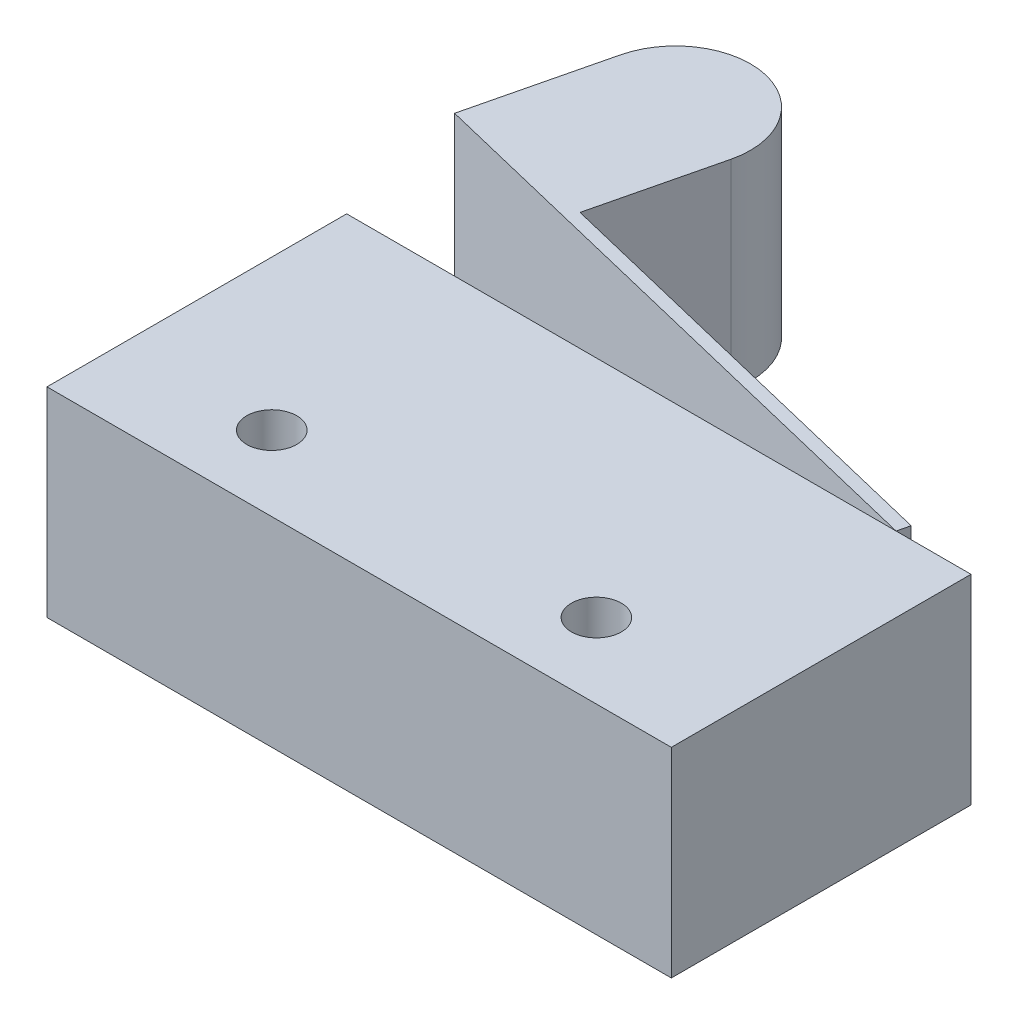
ISO-10303-21;
HEADER;
FILE_DESCRIPTION(('STEP AP214'),'2;1');
FILE_NAME('part.step','',(''),(''),'','','');
FILE_SCHEMA(('AUTOMOTIVE_DESIGN { 1 0 10303 214 1 1 1 1 }'));
ENDSEC;
DATA;
#1=APPLICATION_CONTEXT('core data for automotive mechanical design processes');
#2=APPLICATION_PROTOCOL_DEFINITION('international standard','automotive_design',2000,#1);
#3=PRODUCT_CONTEXT('',#1,'mechanical');
#4=PRODUCT('Part','Part','',(#3));
#5=PRODUCT_RELATED_PRODUCT_CATEGORY('part','',(#4));
#6=PRODUCT_DEFINITION_FORMATION('','',#4);
#7=PRODUCT_DEFINITION_CONTEXT('part definition',#1,'design');
#8=PRODUCT_DEFINITION('design','',#6,#7);
#9=PRODUCT_DEFINITION_SHAPE('','',#8);
#10=(LENGTH_UNIT() NAMED_UNIT(*) SI_UNIT(.MILLI.,.METRE.));
#11=(NAMED_UNIT(*) PLANE_ANGLE_UNIT() SI_UNIT($,.RADIAN.));
#12=(NAMED_UNIT(*) SI_UNIT($,.STERADIAN.) SOLID_ANGLE_UNIT());
#13=UNCERTAINTY_MEASURE_WITH_UNIT(LENGTH_MEASURE(1.E-05),#10,'distance_accuracy_value','');
#14=(GEOMETRIC_REPRESENTATION_CONTEXT(3) GLOBAL_UNCERTAINTY_ASSIGNED_CONTEXT((#13)) GLOBAL_UNIT_ASSIGNED_CONTEXT((#10,
#11,#12)) REPRESENTATION_CONTEXT('',''));
#15=CARTESIAN_POINT('',(0.,0.,0.));
#16=DIRECTION('',(0.,0.,1.));
#17=DIRECTION('',(1.,0.,0.));
#18=AXIS2_PLACEMENT_3D('',#15,#16,#17);
#19=CARTESIAN_POINT('',(7.540625,6.35,-4.7625));
#20=DIRECTION('',(-0.971918724719173,0.,-0.235316791879066));
#21=DIRECTION('',(-0.235316791879066,0.,0.971918724719174));
#22=AXIS2_PLACEMENT_3D('',#19,#20,#21);
#23=PLANE('',#22);
#24=DIRECTION('',(0.235316791879066,0.,-0.971918724719173));
#25=VECTOR('',#24,1.);
#26=CARTESIAN_POINT('',(7.540625,0.,-4.7625));
#27=LINE('',#26,#25);
#28=CARTESIAN_POINT('',(7.540625,0.,-4.7625));
#29=VERTEX_POINT('',#28);
#30=CARTESIAN_POINT('',(7.634016351777,0.,-5.14823024387292));
#31=VERTEX_POINT('',#30);
#32=EDGE_CURVE('E123',#29,#31,#27,.T.);
#33=ORIENTED_EDGE('',*,*,#32,.T.);
#34=DIRECTION('',(0.,-1.,0.));
#35=VECTOR('',#34,1.);
#36=CARTESIAN_POINT('',(7.634016351777,6.35,-5.14823024387292));
#37=LINE('',#36,#35);
#38=CARTESIAN_POINT('',(7.634016351777,6.35,-5.14823024387292));
#39=VERTEX_POINT('',#38);
#40=EDGE_CURVE('E105',#39,#31,#37,.T.);
#41=ORIENTED_EDGE('',*,*,#40,.F.);
#42=DIRECTION('',(0.235316791879066,0.,-0.971918724719173));
#43=VECTOR('',#42,1.);
#44=CARTESIAN_POINT('',(7.540625,6.35,-4.7625));
#45=LINE('',#44,#43);
#46=CARTESIAN_POINT('',(7.540625,6.35,-4.7625));
#47=VERTEX_POINT('',#46);
#48=EDGE_CURVE('E111',#47,#39,#45,.T.);
#49=ORIENTED_EDGE('',*,*,#48,.F.);
#50=DIRECTION('',(0.,-1.,0.));
#51=VECTOR('',#50,1.);
#52=CARTESIAN_POINT('',(7.540625,6.35,-4.7625));
#53=LINE('',#52,#51);
#54=EDGE_CURVE('E150',#47,#29,#53,.T.);
#55=ORIENTED_EDGE('',*,*,#54,.T.);
#56=EDGE_LOOP('',(#33,#41,#49,#55));
#57=FACE_BOUND('',#56,.T.);
#58=ADVANCED_FACE('F45',(#57),#23,.F.);
#59=CARTESIAN_POINT('',(7.634016351777,6.35,-5.14823024387292));
#60=DIRECTION('',(-0.235316791879065,0.,0.971918724719174));
#61=DIRECTION('',(0.971918724719174,0.,0.235316791879065));
#62=AXIS2_PLACEMENT_3D('',#59,#60,#61);
#63=PLANE('',#62);
#64=DIRECTION('',(-0.971918724719174,0.,-0.235316791879065));
#65=VECTOR('',#64,1.);
#66=CARTESIAN_POINT('',(7.634016351777,0.,-5.14823024387292));
#67=LINE('',#66,#65);
#68=CARTESIAN_POINT('',(-6.25227242764819,0.,-8.51031890784506));
#69=VERTEX_POINT('',#68);
#70=EDGE_CURVE('E152',#31,#69,#67,.T.);
#71=ORIENTED_EDGE('',*,*,#70,.T.);
#72=DIRECTION('',(0.,-1.,0.));
#73=VECTOR('',#72,1.);
#74=CARTESIAN_POINT('',(-6.25227242764819,6.35,-8.51031890784506));
#75=LINE('',#74,#73);
#76=CARTESIAN_POINT('',(-6.25227242764819,6.35,-8.51031890784506));
#77=VERTEX_POINT('',#76);
#78=EDGE_CURVE('E108',#77,#69,#75,.T.);
#79=ORIENTED_EDGE('',*,*,#78,.F.);
#80=DIRECTION('',(-0.971918724719174,0.,-0.235316791879065));
#81=VECTOR('',#80,1.);
#82=CARTESIAN_POINT('',(7.634016351777,6.35,-5.14823024387292));
#83=LINE('',#82,#81);
#84=EDGE_CURVE('E101',#39,#77,#83,.T.);
#85=ORIENTED_EDGE('',*,*,#84,.F.);
#86=ORIENTED_EDGE('',*,*,#40,.T.);
#87=EDGE_LOOP('',(#71,#79,#85,#86));
#88=FACE_BOUND('',#87,.T.);
#89=ADVANCED_FACE('F103',(#88),#63,.F.);
#90=CARTESIAN_POINT('',(-4.75801079921613,6.35,-14.6820028098118));
#91=DIRECTION('',(-0.971918724719174,0.,-0.235316791879065));
#92=DIRECTION('',(-0.235316791879065,0.,0.971918724719174));
#93=AXIS2_PLACEMENT_3D('',#90,#91,#92);
#94=PLANE('',#93);
#95=DIRECTION('',(0.235316791879065,0.,-0.971918724719174));
#96=VECTOR('',#95,1.);
#97=CARTESIAN_POINT('',(-4.75801079921613,0.,-14.6820028098118));
#98=LINE('',#97,#96);
#99=CARTESIAN_POINT('',(-5.31835890987816,0.,-12.3676213465743));
#100=VERTEX_POINT('',#99);
#101=EDGE_CURVE('E142',#69,#100,#98,.T.);
#102=ORIENTED_EDGE('',*,*,#101,.T.);
#103=DIRECTION('',(0.,-1.,0.));
#104=VECTOR('',#103,1.);
#105=CARTESIAN_POINT('',(-5.31835890987816,6.35,-12.3676213465743));
#106=LINE('',#105,#104);
#107=CARTESIAN_POINT('',(-5.31835890987816,6.35,-12.3676213465743));
#108=VERTEX_POINT('',#107);
#109=EDGE_CURVE('E133',#100,#108,#106,.F.);
#110=ORIENTED_EDGE('',*,*,#109,.T.);
#111=DIRECTION('',(0.235316791879065,0.,-0.971918724719174));
#112=VECTOR('',#111,1.);
#113=CARTESIAN_POINT('',(-4.75801079921613,6.35,-14.6820028098118));
#114=LINE('',#113,#112);
#115=EDGE_CURVE('E110',#77,#108,#114,.T.);
#116=ORIENTED_EDGE('',*,*,#115,.F.);
#117=ORIENTED_EDGE('',*,*,#78,.T.);
#118=EDGE_LOOP('',(#102,#110,#116,#117));
#119=FACE_BOUND('',#118,.T.);
#120=ADVANCED_FACE('F140',(#119),#94,.F.);
#121=CARTESIAN_POINT('',(-10.9744267059003,6.35,-9.24528488529618));
#122=DIRECTION('',(0.971918724719176,0.,0.235316791879055));
#123=DIRECTION('',(0.235316791879055,0.,-0.971918724719176));
#124=AXIS2_PLACEMENT_3D('',#121,#122,#123);
#125=PLANE('',#124);
#126=DIRECTION('',(-0.235316791879065,0.,0.971918724719174));
#127=VECTOR('',#126,1.);
#128=CARTESIAN_POINT('',(-10.8810353541233,6.35,-9.6310151291691));
#129=LINE('',#128,#127);
#130=CARTESIAN_POINT('',(-9.94712183635323,6.35,-13.4883175678983));
#131=VERTEX_POINT('',#130);
#132=CARTESIAN_POINT('',(-10.9744267059003,6.35,-9.24528488529618));
#133=VERTEX_POINT('',#132);
#134=EDGE_CURVE('E145',#131,#133,#129,.T.);
#135=ORIENTED_EDGE('',*,*,#134,.F.);
#136=DIRECTION('',(0.,-1.,0.));
#137=VECTOR('',#136,1.);
#138=CARTESIAN_POINT('',(-9.94712183635327,6.35,-13.4883175678983));
#139=LINE('',#138,#137);
#140=CARTESIAN_POINT('',(-9.94712183635327,0.,-13.4883175678983));
#141=VERTEX_POINT('',#140);
#142=EDGE_CURVE('E13',#131,#141,#139,.T.);
#143=ORIENTED_EDGE('',*,*,#142,.T.);
#144=DIRECTION('',(-0.235316791879055,0.,0.971918724719176));
#145=VECTOR('',#144,1.);
#146=CARTESIAN_POINT('',(-10.9744267059003,0.,-9.24528488529618));
#147=LINE('',#146,#145);
#148=CARTESIAN_POINT('',(-10.9744267059003,0.,-9.24528488529618));
#149=VERTEX_POINT('',#148);
#150=EDGE_CURVE('E155',#141,#149,#147,.T.);
#151=ORIENTED_EDGE('',*,*,#150,.T.);
#152=DIRECTION('',(0.,-1.,0.));
#153=VECTOR('',#152,1.);
#154=CARTESIAN_POINT('',(-10.9744267059003,6.35,-9.24528488529618));
#155=LINE('',#154,#153);
#156=EDGE_CURVE('E128',#133,#149,#155,.T.);
#157=ORIENTED_EDGE('',*,*,#156,.F.);
#158=EDGE_LOOP('',(#135,#143,#151,#157));
#159=FACE_BOUND('',#158,.T.);
#160=ADVANCED_FACE('F173',(#159),#125,.F.);
#161=CARTESIAN_POINT('',(7.540625,6.35,-4.7625));
#162=DIRECTION('',(0.235316791879065,0.,-0.971918724719174));
#163=DIRECTION('',(-0.971918724719174,0.,-0.235316791879065));
#164=AXIS2_PLACEMENT_3D('',#161,#162,#163);
#165=PLANE('',#164);
#166=DIRECTION('',(0.971918724719174,0.,0.235316791879065));
#167=VECTOR('',#166,1.);
#168=CARTESIAN_POINT('',(7.540625,0.,-4.7625));
#169=LINE('',#168,#167);
#170=EDGE_CURVE('E120',#149,#29,#169,.T.);
#171=ORIENTED_EDGE('',*,*,#170,.T.);
#172=ORIENTED_EDGE('',*,*,#54,.F.);
#173=DIRECTION('',(0.971918724719174,0.,0.235316791879065));
#174=VECTOR('',#173,1.);
#175=CARTESIAN_POINT('',(7.540625,6.35,-4.7625));
#176=LINE('',#175,#174);
#177=EDGE_CURVE('E116',#133,#47,#176,.T.);
#178=ORIENTED_EDGE('',*,*,#177,.F.);
#179=ORIENTED_EDGE('',*,*,#156,.T.);
#180=EDGE_LOOP('',(#171,#172,#178,#179));
#181=FACE_BOUND('',#180,.T.);
#182=ADVANCED_FACE('F162',(#181),#165,.F.);
#183=CARTESIAN_POINT('',(0.,6.35,0.));
#184=DIRECTION('',(0.,1.,0.));
#185=DIRECTION('',(0.,0.,1.));
#186=AXIS2_PLACEMENT_3D('',#183,#184,#185);
#187=PLANE('',#186);
#188=ORIENTED_EDGE('',*,*,#115,.T.);
#189=CARTESIAN_POINT('',(-7.63274037311569,6.35,-12.9279694572363));
#190=DIRECTION('',(0.,1.,0.));
#191=DIRECTION('',(0.,0.,1.));
#192=AXIS2_PLACEMENT_3D('',#189,#190,#191);
#193=CIRCLE('',#192,2.38125);
#194=CARTESIAN_POINT('',(-7.07239226245371,6.35,-15.2423509204738));
#195=VERTEX_POINT('',#194);
#196=EDGE_CURVE('E54',#108,#195,#193,.T.);
#197=ORIENTED_EDGE('',*,*,#196,.T.);
#198=CARTESIAN_POINT('',(-7.63274037311573,6.35,-12.9279694572363));
#199=DIRECTION('',(0.,1.,0.));
#200=DIRECTION('',(0.,0.,1.));
#201=AXIS2_PLACEMENT_3D('',#198,#199,#200);
#202=CIRCLE('',#201,2.38125);
#203=EDGE_CURVE('E61',#195,#131,#202,.T.);
#204=ORIENTED_EDGE('',*,*,#203,.T.);
#205=ORIENTED_EDGE('',*,*,#134,.T.);
#206=ORIENTED_EDGE('',*,*,#177,.T.);
#207=ORIENTED_EDGE('',*,*,#48,.T.);
#208=ORIENTED_EDGE('',*,*,#84,.T.);
#209=EDGE_LOOP('',(#188,#197,#204,#205,#206,#207,#208));
#210=FACE_BOUND('',#209,.T.);
#211=ADVANCED_FACE('F114',(#210),#187,.T.);
#212=CARTESIAN_POINT('',(0.,0.,0.));
#213=DIRECTION('',(0.,1.,0.));
#214=DIRECTION('',(0.,0.,1.));
#215=AXIS2_PLACEMENT_3D('',#212,#213,#214);
#216=PLANE('',#215);
#217=CARTESIAN_POINT('',(-7.63274037311573,0.,-12.9279694572363));
#218=DIRECTION('',(0.,1.,0.));
#219=DIRECTION('',(0.,0.,1.));
#220=AXIS2_PLACEMENT_3D('',#217,#218,#219);
#221=CIRCLE('',#220,2.38125);
#222=CARTESIAN_POINT('',(-7.07239226245371,0.,-15.2423509204738));
#223=VERTEX_POINT('',#222);
#224=EDGE_CURVE('E124',#141,#223,#221,.F.);
#225=ORIENTED_EDGE('',*,*,#224,.T.);
#226=CARTESIAN_POINT('',(-7.63274037311569,0.,-12.9279694572363));
#227=DIRECTION('',(0.,1.,0.));
#228=DIRECTION('',(0.,0.,1.));
#229=AXIS2_PLACEMENT_3D('',#226,#227,#228);
#230=CIRCLE('',#229,2.38125);
#231=EDGE_CURVE('E126',#223,#100,#230,.F.);
#232=ORIENTED_EDGE('',*,*,#231,.T.);
#233=ORIENTED_EDGE('',*,*,#101,.F.);
#234=ORIENTED_EDGE('',*,*,#70,.F.);
#235=ORIENTED_EDGE('',*,*,#32,.F.);
#236=ORIENTED_EDGE('',*,*,#170,.F.);
#237=ORIENTED_EDGE('',*,*,#150,.F.);
#238=EDGE_LOOP('',(#225,#232,#233,#234,#235,#236,#237));
#239=FACE_BOUND('',#238,.T.);
#240=ADVANCED_FACE('F166',(#239),#216,.F.);
#241=CARTESIAN_POINT('',(-7.63274037311573,6.35,-12.9279694572363));
#242=DIRECTION('',(0.,-1.,0.));
#243=DIRECTION('',(0.,0.,-1.));
#244=AXIS2_PLACEMENT_3D('',#241,#242,#243);
#245=CYLINDRICAL_SURFACE('',#244,2.38125);
#246=ORIENTED_EDGE('',*,*,#142,.F.);
#247=ORIENTED_EDGE('',*,*,#203,.F.);
#248=DIRECTION('',(0.,-1.,0.));
#249=VECTOR('',#248,1.);
#250=CARTESIAN_POINT('',(-7.07239226245371,6.35,-15.2423509204738));
#251=LINE('',#250,#249);
#252=EDGE_CURVE('E49',#223,#195,#251,.F.);
#253=ORIENTED_EDGE('',*,*,#252,.F.);
#254=ORIENTED_EDGE('',*,*,#224,.F.);
#255=EDGE_LOOP('',(#246,#247,#253,#254));
#256=FACE_BOUND('',#255,.T.);
#257=ADVANCED_FACE('F47',(#256),#245,.T.);
#258=CARTESIAN_POINT('',(-7.63274037311569,6.35,-12.9279694572363));
#259=DIRECTION('',(0.,-1.,0.));
#260=DIRECTION('',(0.,0.,-1.));
#261=AXIS2_PLACEMENT_3D('',#258,#259,#260);
#262=CYLINDRICAL_SURFACE('',#261,2.38125);
#263=ORIENTED_EDGE('',*,*,#196,.F.);
#264=ORIENTED_EDGE('',*,*,#109,.F.);
#265=ORIENTED_EDGE('',*,*,#231,.F.);
#266=ORIENTED_EDGE('',*,*,#252,.T.);
#267=EDGE_LOOP('',(#263,#264,#265,#266));
#268=FACE_BOUND('',#267,.T.);
#269=ADVANCED_FACE('F170',(#268),#262,.T.);
#270=CLOSED_SHELL('',(#58,#89,#120,#160,#182,#211,#240,#257,#269));
#271=MANIFOLD_SOLID_BREP('B2',#270);
#272=CARTESIAN_POINT('',(9.921875,6.35,4.7625));
#273=DIRECTION('',(-1.,0.,0.));
#274=DIRECTION('',(0.,0.,1.));
#275=AXIS2_PLACEMENT_3D('',#272,#273,#274);
#276=PLANE('',#275);
#277=DIRECTION('',(0.,0.,-1.));
#278=VECTOR('',#277,1.);
#279=CARTESIAN_POINT('',(9.921875,0.,4.7625));
#280=LINE('',#279,#278);
#281=CARTESIAN_POINT('',(9.921875,0.,4.7625));
#282=VERTEX_POINT('',#281);
#283=CARTESIAN_POINT('',(9.921875,0.,-4.7625));
#284=VERTEX_POINT('',#283);
#285=EDGE_CURVE('E313',#282,#284,#280,.T.);
#286=ORIENTED_EDGE('',*,*,#285,.T.);
#287=DIRECTION('',(0.,-1.,0.));
#288=VECTOR('',#287,1.);
#289=CARTESIAN_POINT('',(9.921875,6.35,-4.7625));
#290=LINE('',#289,#288);
#291=CARTESIAN_POINT('',(9.921875,6.35,-4.7625));
#292=VERTEX_POINT('',#291);
#293=EDGE_CURVE('E43',#292,#284,#290,.T.);
#294=ORIENTED_EDGE('',*,*,#293,.F.);
#295=DIRECTION('',(0.,0.,-1.));
#296=VECTOR('',#295,1.);
#297=CARTESIAN_POINT('',(9.921875,6.35,4.7625));
#298=LINE('',#297,#296);
#299=CARTESIAN_POINT('',(9.921875,6.35,4.7625));
#300=VERTEX_POINT('',#299);
#301=EDGE_CURVE('E301',#300,#292,#298,.T.);
#302=ORIENTED_EDGE('',*,*,#301,.F.);
#303=DIRECTION('',(0.,-1.,0.));
#304=VECTOR('',#303,1.);
#305=CARTESIAN_POINT('',(9.921875,6.35,4.7625));
#306=LINE('',#305,#304);
#307=EDGE_CURVE('E309',#300,#282,#306,.T.);
#308=ORIENTED_EDGE('',*,*,#307,.T.);
#309=EDGE_LOOP('',(#286,#294,#302,#308));
#310=FACE_BOUND('',#309,.T.);
#311=ADVANCED_FACE('F250',(#310),#276,.F.);
#312=CARTESIAN_POINT('',(-9.921875,6.35,-4.7625));
#313=DIRECTION('',(0.,0.,1.));
#314=DIRECTION('',(1.,0.,0.));
#315=AXIS2_PLACEMENT_3D('',#312,#313,#314);
#316=PLANE('',#315);
#317=DIRECTION('',(-1.,0.,0.));
#318=VECTOR('',#317,1.);
#319=CARTESIAN_POINT('',(-9.921875,0.,-4.7625));
#320=LINE('',#319,#318);
#321=CARTESIAN_POINT('',(-9.921875,0.,-4.7625));
#322=VERTEX_POINT('',#321);
#323=EDGE_CURVE('E305',#284,#322,#320,.T.);
#324=ORIENTED_EDGE('',*,*,#323,.T.);
#325=DIRECTION('',(0.,-1.,0.));
#326=VECTOR('',#325,1.);
#327=CARTESIAN_POINT('',(-9.921875,6.35,-4.7625));
#328=LINE('',#327,#326);
#329=CARTESIAN_POINT('',(-9.921875,6.35,-4.7625));
#330=VERTEX_POINT('',#329);
#331=EDGE_CURVE('E258',#330,#322,#328,.T.);
#332=ORIENTED_EDGE('',*,*,#331,.F.);
#333=DIRECTION('',(-1.,0.,0.));
#334=VECTOR('',#333,1.);
#335=CARTESIAN_POINT('',(-9.921875,6.35,-4.7625));
#336=LINE('',#335,#334);
#337=EDGE_CURVE('E296',#292,#330,#336,.T.);
#338=ORIENTED_EDGE('',*,*,#337,.F.);
#339=ORIENTED_EDGE('',*,*,#293,.T.);
#340=EDGE_LOOP('',(#324,#332,#338,#339));
#341=FACE_BOUND('',#340,.T.);
#342=ADVANCED_FACE('F304',(#341),#316,.F.);
#343=CARTESIAN_POINT('',(-9.921875,6.35,4.7625));
#344=DIRECTION('',(1.,0.,0.));
#345=DIRECTION('',(0.,0.,-1.));
#346=AXIS2_PLACEMENT_3D('',#343,#344,#345);
#347=PLANE('',#346);
#348=DIRECTION('',(0.,0.,1.));
#349=VECTOR('',#348,1.);
#350=CARTESIAN_POINT('',(-9.921875,0.,4.7625));
#351=LINE('',#350,#349);
#352=CARTESIAN_POINT('',(-9.921875,0.,4.7625));
#353=VERTEX_POINT('',#352);
#354=EDGE_CURVE('E283',#322,#353,#351,.T.);
#355=ORIENTED_EDGE('',*,*,#354,.T.);
#356=DIRECTION('',(0.,-1.,0.));
#357=VECTOR('',#356,1.);
#358=CARTESIAN_POINT('',(-9.921875,6.35,4.7625));
#359=LINE('',#358,#357);
#360=CARTESIAN_POINT('',(-9.921875,6.35,4.7625));
#361=VERTEX_POINT('',#360);
#362=EDGE_CURVE('E306',#361,#353,#359,.T.);
#363=ORIENTED_EDGE('',*,*,#362,.F.);
#364=DIRECTION('',(0.,0.,1.));
#365=VECTOR('',#364,1.);
#366=CARTESIAN_POINT('',(-9.921875,6.35,4.7625));
#367=LINE('',#366,#365);
#368=EDGE_CURVE('E299',#330,#361,#367,.T.);
#369=ORIENTED_EDGE('',*,*,#368,.F.);
#370=ORIENTED_EDGE('',*,*,#331,.T.);
#371=EDGE_LOOP('',(#355,#363,#369,#370));
#372=FACE_BOUND('',#371,.T.);
#373=ADVANCED_FACE('F307',(#372),#347,.F.);
#374=CARTESIAN_POINT('',(-9.921875,6.35,4.7625));
#375=DIRECTION('',(0.,0.,-1.));
#376=DIRECTION('',(-1.,0.,0.));
#377=AXIS2_PLACEMENT_3D('',#374,#375,#376);
#378=PLANE('',#377);
#379=DIRECTION('',(1.,0.,0.));
#380=VECTOR('',#379,1.);
#381=CARTESIAN_POINT('',(-9.921875,0.,4.7625));
#382=LINE('',#381,#380);
#383=EDGE_CURVE('E289',#353,#282,#382,.T.);
#384=ORIENTED_EDGE('',*,*,#383,.T.);
#385=ORIENTED_EDGE('',*,*,#307,.F.);
#386=DIRECTION('',(1.,0.,0.));
#387=VECTOR('',#386,1.);
#388=CARTESIAN_POINT('',(-9.921875,6.35,4.7625));
#389=LINE('',#388,#387);
#390=EDGE_CURVE('E266',#361,#300,#389,.T.);
#391=ORIENTED_EDGE('',*,*,#390,.F.);
#392=ORIENTED_EDGE('',*,*,#362,.T.);
#393=EDGE_LOOP('',(#384,#385,#391,#392));
#394=FACE_BOUND('',#393,.T.);
#395=ADVANCED_FACE('F321',(#394),#378,.F.);
#396=CARTESIAN_POINT('',(0.,6.35,0.));
#397=DIRECTION('',(0.,-1.,0.));
#398=DIRECTION('',(0.,0.,-1.));
#399=AXIS2_PLACEMENT_3D('',#396,#397,#398);
#400=PLANE('',#399);
#401=CARTESIAN_POINT('',(5.159375,6.35,2.38125));
#402=DIRECTION('',(0.,1.,0.));
#403=DIRECTION('',(0.,0.,1.));
#404=AXIS2_PLACEMENT_3D('',#401,#402,#403);
#405=CIRCLE('',#404,0.79375);
#406=CARTESIAN_POINT('',(5.159375,6.35,3.175));
#407=VERTEX_POINT('',#406);
#408=EDGE_CURVE('E333',#407,#407,#405,.T.);
#409=ORIENTED_EDGE('',*,*,#408,.F.);
#410=EDGE_LOOP('',(#409));
#411=FACE_BOUND('',#410,.T.);
#412=CARTESIAN_POINT('',(-5.159375,6.35,2.38125));
#413=DIRECTION('',(0.,1.,0.));
#414=DIRECTION('',(0.,0.,1.));
#415=AXIS2_PLACEMENT_3D('',#412,#413,#414);
#416=CIRCLE('',#415,0.79375);
#417=CARTESIAN_POINT('',(-5.159375,6.35,3.175));
#418=VERTEX_POINT('',#417);
#419=EDGE_CURVE('E327',#418,#418,#416,.T.);
#420=ORIENTED_EDGE('',*,*,#419,.F.);
#421=EDGE_LOOP('',(#420));
#422=FACE_BOUND('',#421,.T.);
#423=ORIENTED_EDGE('',*,*,#301,.T.);
#424=ORIENTED_EDGE('',*,*,#337,.T.);
#425=ORIENTED_EDGE('',*,*,#368,.T.);
#426=ORIENTED_EDGE('',*,*,#390,.T.);
#427=EDGE_LOOP('',(#423,#424,#425,#426));
#428=FACE_BOUND('',#427,.T.);
#429=ADVANCED_FACE('F297',(#411,#422,#428),#400,.F.);
#430=CARTESIAN_POINT('',(0.,0.,0.));
#431=DIRECTION('',(0.,-1.,0.));
#432=DIRECTION('',(0.,0.,-1.));
#433=AXIS2_PLACEMENT_3D('',#430,#431,#432);
#434=PLANE('',#433);
#435=CARTESIAN_POINT('',(5.159375,0.,2.38125));
#436=DIRECTION('',(0.,1.,0.));
#437=DIRECTION('',(0.,0.,1.));
#438=AXIS2_PLACEMENT_3D('',#435,#436,#437);
#439=CIRCLE('',#438,0.79375);
#440=CARTESIAN_POINT('',(5.159375,0.,3.175));
#441=VERTEX_POINT('',#440);
#442=EDGE_CURVE('E330',#441,#441,#439,.T.);
#443=ORIENTED_EDGE('',*,*,#442,.T.);
#444=EDGE_LOOP('',(#443));
#445=FACE_BOUND('',#444,.T.);
#446=CARTESIAN_POINT('',(-5.159375,0.,2.38125));
#447=DIRECTION('',(0.,1.,0.));
#448=DIRECTION('',(0.,0.,1.));
#449=AXIS2_PLACEMENT_3D('',#446,#447,#448);
#450=CIRCLE('',#449,0.79375);
#451=CARTESIAN_POINT('',(-5.159375,0.,3.175));
#452=VERTEX_POINT('',#451);
#453=EDGE_CURVE('E316',#452,#452,#450,.T.);
#454=ORIENTED_EDGE('',*,*,#453,.T.);
#455=EDGE_LOOP('',(#454));
#456=FACE_BOUND('',#455,.T.);
#457=ORIENTED_EDGE('',*,*,#285,.F.);
#458=ORIENTED_EDGE('',*,*,#383,.F.);
#459=ORIENTED_EDGE('',*,*,#354,.F.);
#460=ORIENTED_EDGE('',*,*,#323,.F.);
#461=EDGE_LOOP('',(#457,#458,#459,#460));
#462=FACE_BOUND('',#461,.T.);
#463=ADVANCED_FACE('F324',(#445,#456,#462),#434,.T.);
#464=CARTESIAN_POINT('',(-5.159375,0.,2.38125));
#465=DIRECTION('',(0.,1.,0.));
#466=DIRECTION('',(0.,0.,1.));
#467=AXIS2_PLACEMENT_3D('',#464,#465,#466);
#468=CYLINDRICAL_SURFACE('',#467,0.79375);
#469=ORIENTED_EDGE('',*,*,#453,.F.);
#470=EDGE_LOOP('',(#469));
#471=FACE_BOUND('',#470,.T.);
#472=ORIENTED_EDGE('',*,*,#419,.T.);
#473=EDGE_LOOP('',(#472));
#474=FACE_BOUND('',#473,.T.);
#475=ADVANCED_FACE('F344',(#471,#474),#468,.F.);
#476=CARTESIAN_POINT('',(5.159375,0.,2.38125));
#477=DIRECTION('',(0.,1.,0.));
#478=DIRECTION('',(0.,0.,1.));
#479=AXIS2_PLACEMENT_3D('',#476,#477,#478);
#480=CYLINDRICAL_SURFACE('',#479,0.79375);
#481=ORIENTED_EDGE('',*,*,#442,.F.);
#482=EDGE_LOOP('',(#481));
#483=FACE_BOUND('',#482,.T.);
#484=ORIENTED_EDGE('',*,*,#408,.T.);
#485=EDGE_LOOP('',(#484));
#486=FACE_BOUND('',#485,.T.);
#487=ADVANCED_FACE('F341',(#483,#486),#480,.F.);
#488=CLOSED_SHELL('',(#311,#342,#373,#395,#429,#463,#475,#487));
#489=MANIFOLD_SOLID_BREP('B7',#488);
#490=ADVANCED_BREP_SHAPE_REPRESENTATION('',(#18,#271,#489),#14);
#491=SHAPE_DEFINITION_REPRESENTATION(#9,#490);
ENDSEC;
END-ISO-10303-21;
